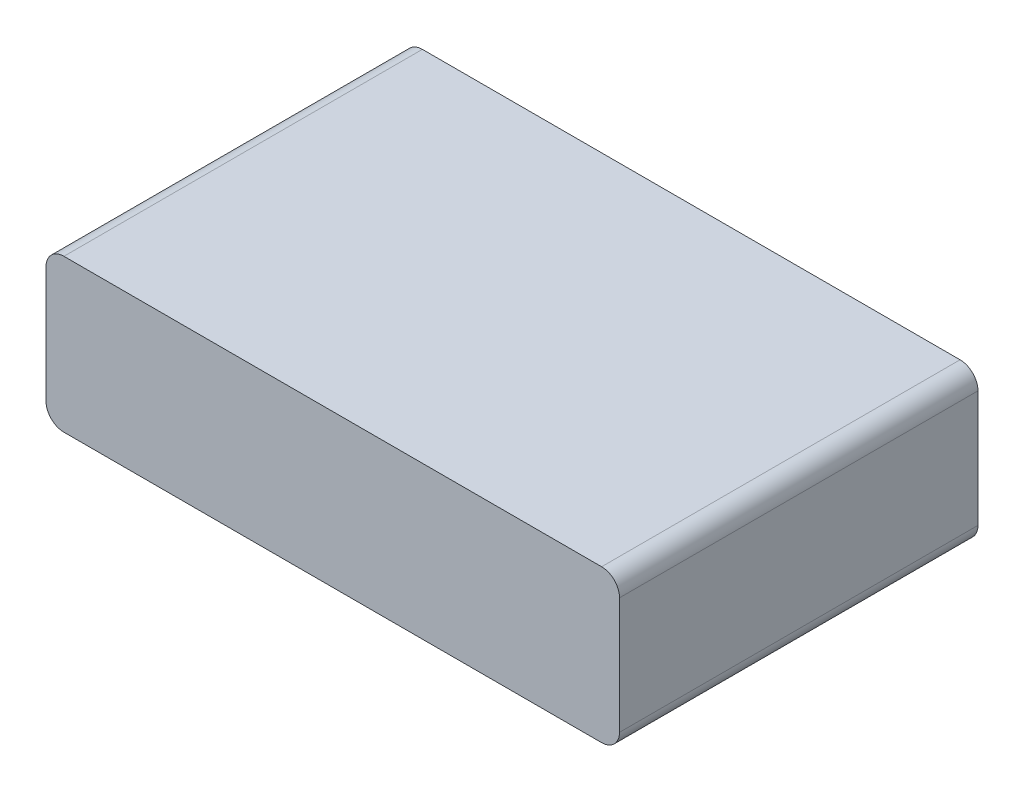
ISO-10303-21;
HEADER;
FILE_DESCRIPTION(('STEP AP214'),'2;1');
FILE_NAME('part.step','',(''),(''),'','','');
FILE_SCHEMA(('AUTOMOTIVE_DESIGN { 1 0 10303 214 1 1 1 1 }'));
ENDSEC;
DATA;
#1=APPLICATION_CONTEXT('core data for automotive mechanical design processes');
#2=APPLICATION_PROTOCOL_DEFINITION('international standard','automotive_design',2000,#1);
#3=PRODUCT_CONTEXT('',#1,'mechanical');
#4=PRODUCT('Part','Part','',(#3));
#5=PRODUCT_RELATED_PRODUCT_CATEGORY('part','',(#4));
#6=PRODUCT_DEFINITION_FORMATION('','',#4);
#7=PRODUCT_DEFINITION_CONTEXT('part definition',#1,'design');
#8=PRODUCT_DEFINITION('design','',#6,#7);
#9=PRODUCT_DEFINITION_SHAPE('','',#8);
#10=(LENGTH_UNIT() NAMED_UNIT(*) SI_UNIT(.MILLI.,.METRE.));
#11=(NAMED_UNIT(*) PLANE_ANGLE_UNIT() SI_UNIT($,.RADIAN.));
#12=(NAMED_UNIT(*) SI_UNIT($,.STERADIAN.) SOLID_ANGLE_UNIT());
#13=UNCERTAINTY_MEASURE_WITH_UNIT(LENGTH_MEASURE(1.E-05),#10,'distance_accuracy_value','');
#14=(GEOMETRIC_REPRESENTATION_CONTEXT(3) GLOBAL_UNCERTAINTY_ASSIGNED_CONTEXT((#13)) GLOBAL_UNIT_ASSIGNED_CONTEXT((#10,
#11,#12)) REPRESENTATION_CONTEXT('',''));
#15=CARTESIAN_POINT('',(0.,0.,0.));
#16=DIRECTION('',(0.,0.,1.));
#17=DIRECTION('',(1.,0.,0.));
#18=AXIS2_PLACEMENT_3D('',#15,#16,#17);
#19=CARTESIAN_POINT('',(32.,8.5,-20.));
#20=DIRECTION('',(-1.,0.,0.));
#21=DIRECTION('',(0.,0.,1.));
#22=AXIS2_PLACEMENT_3D('',#19,#20,#21);
#23=PLANE('',#22);
#24=DIRECTION('',(0.,-1.,0.));
#25=VECTOR('',#24,1.);
#26=CARTESIAN_POINT('',(32.,8.5,20.));
#27=LINE('',#26,#25);
#28=CARTESIAN_POINT('',(32.,6.5,20.));
#29=VERTEX_POINT('',#28);
#30=CARTESIAN_POINT('',(32.,-6.5,20.));
#31=VERTEX_POINT('',#30);
#32=EDGE_CURVE('E121',#29,#31,#27,.T.);
#33=ORIENTED_EDGE('',*,*,#32,.T.);
#34=DIRECTION('',(0.,0.,-1.));
#35=VECTOR('',#34,1.);
#36=CARTESIAN_POINT('',(32.,-6.5,-20.));
#37=LINE('',#36,#35);
#38=CARTESIAN_POINT('',(32.,-6.5,-20.));
#39=VERTEX_POINT('',#38);
#40=EDGE_CURVE('E11',#31,#39,#37,.T.);
#41=ORIENTED_EDGE('',*,*,#40,.T.);
#42=DIRECTION('',(0.,-1.,0.));
#43=VECTOR('',#42,1.);
#44=CARTESIAN_POINT('',(32.,8.5,-20.));
#45=LINE('',#44,#43);
#46=CARTESIAN_POINT('',(32.,6.5,-20.));
#47=VERTEX_POINT('',#46);
#48=EDGE_CURVE('E126',#47,#39,#45,.T.);
#49=ORIENTED_EDGE('',*,*,#48,.F.);
#50=DIRECTION('',(0.,0.,-1.));
#51=VECTOR('',#50,1.);
#52=CARTESIAN_POINT('',(32.,6.5,20.));
#53=LINE('',#52,#51);
#54=EDGE_CURVE('E41',#47,#29,#53,.F.);
#55=ORIENTED_EDGE('',*,*,#54,.T.);
#56=EDGE_LOOP('',(#33,#41,#49,#55));
#57=FACE_BOUND('',#56,.T.);
#58=ADVANCED_FACE('F33',(#57),#23,.F.);
#59=CARTESIAN_POINT('',(-32.,8.5,-20.));
#60=DIRECTION('',(0.,0.,1.));
#61=DIRECTION('',(1.,0.,0.));
#62=AXIS2_PLACEMENT_3D('',#59,#60,#61);
#63=PLANE('',#62);
#64=DIRECTION('',(-1.,0.,0.));
#65=VECTOR('',#64,1.);
#66=CARTESIAN_POINT('',(-32.,-8.5,-20.));
#67=LINE('',#66,#65);
#68=CARTESIAN_POINT('',(30.,-8.5,-20.));
#69=VERTEX_POINT('',#68);
#70=CARTESIAN_POINT('',(-30.,-8.5,-20.));
#71=VERTEX_POINT('',#70);
#72=EDGE_CURVE('E168',#69,#71,#67,.T.);
#73=ORIENTED_EDGE('',*,*,#72,.T.);
#74=CARTESIAN_POINT('',(-30.,-6.5,-20.));
#75=DIRECTION('',(0.,0.,1.));
#76=DIRECTION('',(1.,0.,0.));
#77=AXIS2_PLACEMENT_3D('',#74,#75,#76);
#78=CIRCLE('',#77,2.);
#79=CARTESIAN_POINT('',(-32.,-6.5,-20.));
#80=VERTEX_POINT('',#79);
#81=EDGE_CURVE('E143',#71,#80,#78,.F.);
#82=ORIENTED_EDGE('',*,*,#81,.T.);
#83=DIRECTION('',(0.,-1.,0.));
#84=VECTOR('',#83,1.);
#85=CARTESIAN_POINT('',(-32.,8.5,-20.));
#86=LINE('',#85,#84);
#87=CARTESIAN_POINT('',(-32.,6.5,-20.));
#88=VERTEX_POINT('',#87);
#89=EDGE_CURVE('E120',#88,#80,#86,.T.);
#90=ORIENTED_EDGE('',*,*,#89,.F.);
#91=CARTESIAN_POINT('',(-30.,6.5,-20.));
#92=DIRECTION('',(0.,0.,1.));
#93=DIRECTION('',(1.,0.,0.));
#94=AXIS2_PLACEMENT_3D('',#91,#92,#93);
#95=CIRCLE('',#94,2.);
#96=CARTESIAN_POINT('',(-30.,8.5,-20.));
#97=VERTEX_POINT('',#96);
#98=EDGE_CURVE('E125',#88,#97,#95,.F.);
#99=ORIENTED_EDGE('',*,*,#98,.T.);
#100=DIRECTION('',(-1.,0.,0.));
#101=VECTOR('',#100,1.);
#102=CARTESIAN_POINT('',(-32.,8.5,-20.));
#103=LINE('',#102,#101);
#104=CARTESIAN_POINT('',(30.,8.5,-20.));
#105=VERTEX_POINT('',#104);
#106=EDGE_CURVE('E162',#105,#97,#103,.T.);
#107=ORIENTED_EDGE('',*,*,#106,.F.);
#108=CARTESIAN_POINT('',(30.,6.5,-20.));
#109=DIRECTION('',(0.,0.,1.));
#110=DIRECTION('',(1.,0.,0.));
#111=AXIS2_PLACEMENT_3D('',#108,#109,#110);
#112=CIRCLE('',#111,2.);
#113=EDGE_CURVE('E55',#105,#47,#112,.F.);
#114=ORIENTED_EDGE('',*,*,#113,.T.);
#115=ORIENTED_EDGE('',*,*,#48,.T.);
#116=CARTESIAN_POINT('',(30.,-6.5,-20.));
#117=DIRECTION('',(0.,0.,1.));
#118=DIRECTION('',(1.,0.,0.));
#119=AXIS2_PLACEMENT_3D('',#116,#117,#118);
#120=CIRCLE('',#119,2.);
#121=EDGE_CURVE('E48',#39,#69,#120,.F.);
#122=ORIENTED_EDGE('',*,*,#121,.T.);
#123=EDGE_LOOP('',(#73,#82,#90,#99,#107,#114,#115,#122));
#124=FACE_BOUND('',#123,.T.);
#125=ADVANCED_FACE('F164',(#124),#63,.F.);
#126=CARTESIAN_POINT('',(-32.,8.5,-20.));
#127=DIRECTION('',(1.,0.,0.));
#128=DIRECTION('',(0.,0.,-1.));
#129=AXIS2_PLACEMENT_3D('',#126,#127,#128);
#130=PLANE('',#129);
#131=ORIENTED_EDGE('',*,*,#89,.T.);
#132=DIRECTION('',(0.,0.,1.));
#133=VECTOR('',#132,1.);
#134=CARTESIAN_POINT('',(-32.,-6.5,-20.));
#135=LINE('',#134,#133);
#136=CARTESIAN_POINT('',(-32.,-6.5,20.));
#137=VERTEX_POINT('',#136);
#138=EDGE_CURVE('E119',#80,#137,#135,.T.);
#139=ORIENTED_EDGE('',*,*,#138,.T.);
#140=DIRECTION('',(0.,-1.,0.));
#141=VECTOR('',#140,1.);
#142=CARTESIAN_POINT('',(-32.,8.5,20.));
#143=LINE('',#142,#141);
#144=CARTESIAN_POINT('',(-32.,6.5,20.));
#145=VERTEX_POINT('',#144);
#146=EDGE_CURVE('E102',#145,#137,#143,.T.);
#147=ORIENTED_EDGE('',*,*,#146,.F.);
#148=DIRECTION('',(0.,0.,1.));
#149=VECTOR('',#148,1.);
#150=CARTESIAN_POINT('',(-32.,6.5,-20.));
#151=LINE('',#150,#149);
#152=EDGE_CURVE('E116',#145,#88,#151,.F.);
#153=ORIENTED_EDGE('',*,*,#152,.T.);
#154=EDGE_LOOP('',(#131,#139,#147,#153));
#155=FACE_BOUND('',#154,.T.);
#156=ADVANCED_FACE('F115',(#155),#130,.F.);
#157=CARTESIAN_POINT('',(-32.,8.5,20.));
#158=DIRECTION('',(0.,0.,-1.));
#159=DIRECTION('',(-1.,0.,0.));
#160=AXIS2_PLACEMENT_3D('',#157,#158,#159);
#161=PLANE('',#160);
#162=ORIENTED_EDGE('',*,*,#146,.T.);
#163=CARTESIAN_POINT('',(-30.,-6.5,20.));
#164=DIRECTION('',(0.,0.,-1.));
#165=DIRECTION('',(-1.,0.,0.));
#166=AXIS2_PLACEMENT_3D('',#163,#164,#165);
#167=CIRCLE('',#166,2.);
#168=CARTESIAN_POINT('',(-30.,-8.5,20.));
#169=VERTEX_POINT('',#168);
#170=EDGE_CURVE('E109',#137,#169,#167,.F.);
#171=ORIENTED_EDGE('',*,*,#170,.T.);
#172=DIRECTION('',(1.,0.,0.));
#173=VECTOR('',#172,1.);
#174=CARTESIAN_POINT('',(-32.,-8.5,20.));
#175=LINE('',#174,#173);
#176=CARTESIAN_POINT('',(30.,-8.5,20.));
#177=VERTEX_POINT('',#176);
#178=EDGE_CURVE('E165',#169,#177,#175,.T.);
#179=ORIENTED_EDGE('',*,*,#178,.T.);
#180=CARTESIAN_POINT('',(30.,-6.5,20.));
#181=DIRECTION('',(0.,0.,-1.));
#182=DIRECTION('',(-1.,0.,0.));
#183=AXIS2_PLACEMENT_3D('',#180,#181,#182);
#184=CIRCLE('',#183,2.);
#185=EDGE_CURVE('E110',#177,#31,#184,.F.);
#186=ORIENTED_EDGE('',*,*,#185,.T.);
#187=ORIENTED_EDGE('',*,*,#32,.F.);
#188=CARTESIAN_POINT('',(30.,6.5,20.));
#189=DIRECTION('',(0.,0.,-1.));
#190=DIRECTION('',(-1.,0.,0.));
#191=AXIS2_PLACEMENT_3D('',#188,#189,#190);
#192=CIRCLE('',#191,2.);
#193=CARTESIAN_POINT('',(30.,8.5,20.));
#194=VERTEX_POINT('',#193);
#195=EDGE_CURVE('E128',#29,#194,#192,.F.);
#196=ORIENTED_EDGE('',*,*,#195,.T.);
#197=DIRECTION('',(1.,0.,0.));
#198=VECTOR('',#197,1.);
#199=CARTESIAN_POINT('',(-32.,8.5,20.));
#200=LINE('',#199,#198);
#201=CARTESIAN_POINT('',(-30.,8.5,20.));
#202=VERTEX_POINT('',#201);
#203=EDGE_CURVE('E104',#202,#194,#200,.T.);
#204=ORIENTED_EDGE('',*,*,#203,.F.);
#205=CARTESIAN_POINT('',(-30.,6.5,20.));
#206=DIRECTION('',(0.,0.,-1.));
#207=DIRECTION('',(-1.,0.,0.));
#208=AXIS2_PLACEMENT_3D('',#205,#206,#207);
#209=CIRCLE('',#208,2.);
#210=EDGE_CURVE('E99',#202,#145,#209,.F.);
#211=ORIENTED_EDGE('',*,*,#210,.T.);
#212=EDGE_LOOP('',(#162,#171,#179,#186,#187,#196,#204,#211));
#213=FACE_BOUND('',#212,.T.);
#214=ADVANCED_FACE('F101',(#213),#161,.F.);
#215=CARTESIAN_POINT('',(0.,8.5,0.));
#216=DIRECTION('',(0.,1.,0.));
#217=DIRECTION('',(0.,0.,1.));
#218=AXIS2_PLACEMENT_3D('',#215,#216,#217);
#219=PLANE('',#218);
#220=ORIENTED_EDGE('',*,*,#106,.T.);
#221=DIRECTION('',(0.,0.,1.));
#222=VECTOR('',#221,1.);
#223=CARTESIAN_POINT('',(-30.,8.5,20.));
#224=LINE('',#223,#222);
#225=EDGE_CURVE('E148',#97,#202,#224,.T.);
#226=ORIENTED_EDGE('',*,*,#225,.T.);
#227=ORIENTED_EDGE('',*,*,#203,.T.);
#228=DIRECTION('',(0.,0.,-1.));
#229=VECTOR('',#228,1.);
#230=CARTESIAN_POINT('',(30.,8.5,-20.));
#231=LINE('',#230,#229);
#232=EDGE_CURVE('E145',#194,#105,#231,.T.);
#233=ORIENTED_EDGE('',*,*,#232,.T.);
#234=EDGE_LOOP('',(#220,#226,#227,#233));
#235=FACE_BOUND('',#234,.T.);
#236=ADVANCED_FACE('F161',(#235),#219,.T.);
#237=CARTESIAN_POINT('',(0.,-8.5,0.));
#238=DIRECTION('',(0.,1.,0.));
#239=DIRECTION('',(0.,0.,1.));
#240=AXIS2_PLACEMENT_3D('',#237,#238,#239);
#241=PLANE('',#240);
#242=ORIENTED_EDGE('',*,*,#178,.F.);
#243=DIRECTION('',(0.,0.,1.));
#244=VECTOR('',#243,1.);
#245=CARTESIAN_POINT('',(-30.,-8.5,0.));
#246=LINE('',#245,#244);
#247=EDGE_CURVE('E138',#169,#71,#246,.F.);
#248=ORIENTED_EDGE('',*,*,#247,.T.);
#249=ORIENTED_EDGE('',*,*,#72,.F.);
#250=DIRECTION('',(0.,0.,-1.));
#251=VECTOR('',#250,1.);
#252=CARTESIAN_POINT('',(30.,-8.5,0.));
#253=LINE('',#252,#251);
#254=EDGE_CURVE('E136',#69,#177,#253,.F.);
#255=ORIENTED_EDGE('',*,*,#254,.T.);
#256=EDGE_LOOP('',(#242,#248,#249,#255));
#257=FACE_BOUND('',#256,.T.);
#258=ADVANCED_FACE('F177',(#257),#241,.F.);
#259=CARTESIAN_POINT('',(-30.,-6.5,-20.));
#260=DIRECTION('',(0.,0.,1.));
#261=DIRECTION('',(1.,0.,0.));
#262=AXIS2_PLACEMENT_3D('',#259,#260,#261);
#263=CYLINDRICAL_SURFACE('',#262,2.);
#264=ORIENTED_EDGE('',*,*,#81,.F.);
#265=ORIENTED_EDGE('',*,*,#247,.F.);
#266=ORIENTED_EDGE('',*,*,#170,.F.);
#267=ORIENTED_EDGE('',*,*,#138,.F.);
#268=EDGE_LOOP('',(#264,#265,#266,#267));
#269=FACE_BOUND('',#268,.T.);
#270=ADVANCED_FACE('F173',(#269),#263,.T.);
#271=CARTESIAN_POINT('',(-30.,6.5,0.));
#272=DIRECTION('',(0.,0.,-1.));
#273=DIRECTION('',(-1.,0.,0.));
#274=AXIS2_PLACEMENT_3D('',#271,#272,#273);
#275=CYLINDRICAL_SURFACE('',#274,2.);
#276=ORIENTED_EDGE('',*,*,#98,.F.);
#277=ORIENTED_EDGE('',*,*,#152,.F.);
#278=ORIENTED_EDGE('',*,*,#210,.F.);
#279=ORIENTED_EDGE('',*,*,#225,.F.);
#280=EDGE_LOOP('',(#276,#277,#278,#279));
#281=FACE_BOUND('',#280,.T.);
#282=ADVANCED_FACE('F124',(#281),#275,.T.);
#283=CARTESIAN_POINT('',(30.,-6.5,-20.));
#284=DIRECTION('',(0.,0.,-1.));
#285=DIRECTION('',(-1.,0.,0.));
#286=AXIS2_PLACEMENT_3D('',#283,#284,#285);
#287=CYLINDRICAL_SURFACE('',#286,2.);
#288=ORIENTED_EDGE('',*,*,#185,.F.);
#289=ORIENTED_EDGE('',*,*,#254,.F.);
#290=ORIENTED_EDGE('',*,*,#121,.F.);
#291=ORIENTED_EDGE('',*,*,#40,.F.);
#292=EDGE_LOOP('',(#288,#289,#290,#291));
#293=FACE_BOUND('',#292,.T.);
#294=ADVANCED_FACE('F179',(#293),#287,.T.);
#295=CARTESIAN_POINT('',(30.,6.5,0.));
#296=DIRECTION('',(0.,0.,1.));
#297=DIRECTION('',(1.,0.,0.));
#298=AXIS2_PLACEMENT_3D('',#295,#296,#297);
#299=CYLINDRICAL_SURFACE('',#298,2.);
#300=ORIENTED_EDGE('',*,*,#195,.F.);
#301=ORIENTED_EDGE('',*,*,#54,.F.);
#302=ORIENTED_EDGE('',*,*,#113,.F.);
#303=ORIENTED_EDGE('',*,*,#232,.F.);
#304=EDGE_LOOP('',(#300,#301,#302,#303));
#305=FACE_BOUND('',#304,.T.);
#306=ADVANCED_FACE('F35',(#305),#299,.T.);
#307=CLOSED_SHELL('',(#58,#125,#156,#214,#236,#258,#270,#282,#294,#306));
#308=MANIFOLD_SOLID_BREP('B2',#307);
#309=ADVANCED_BREP_SHAPE_REPRESENTATION('',(#18,#308),#14);
#310=SHAPE_DEFINITION_REPRESENTATION(#9,#309);
ENDSEC;
END-ISO-10303-21;
